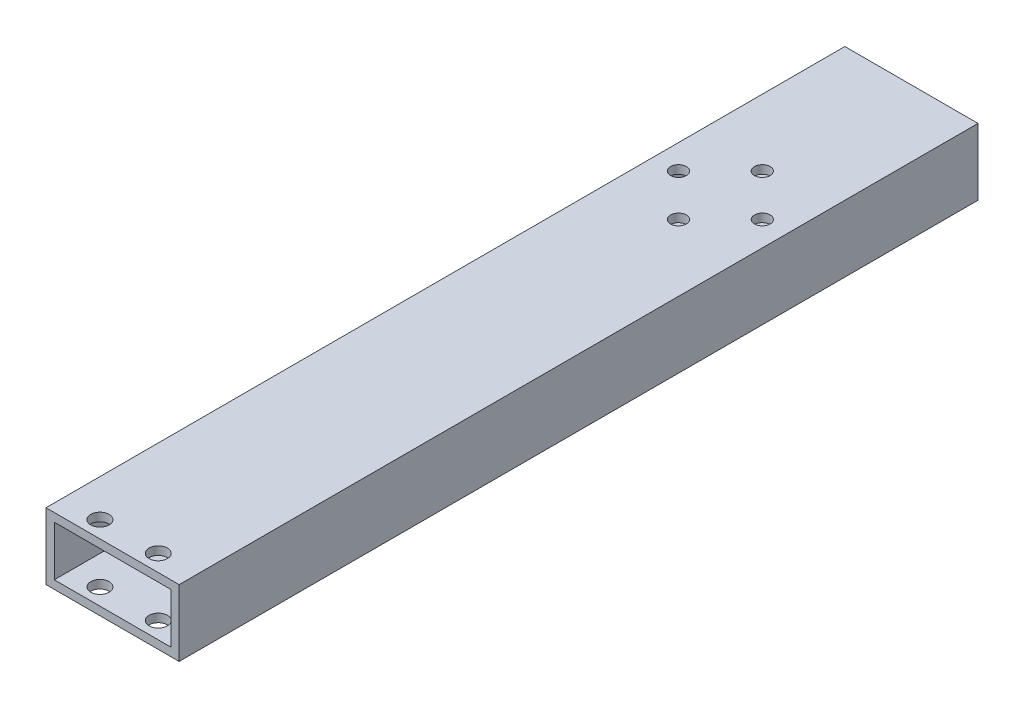
ISO-10303-21;
HEADER;
FILE_DESCRIPTION(('STEP AP214'),'2;1');
FILE_NAME('part.step','',(''),(''),'','','');
FILE_SCHEMA(('AUTOMOTIVE_DESIGN { 1 0 10303 214 1 1 1 1 }'));
ENDSEC;
DATA;
#1=APPLICATION_CONTEXT('core data for automotive mechanical design processes');
#2=APPLICATION_PROTOCOL_DEFINITION('international standard','automotive_design',2000,#1);
#3=PRODUCT_CONTEXT('',#1,'mechanical');
#4=PRODUCT('Part','Part','',(#3));
#5=PRODUCT_RELATED_PRODUCT_CATEGORY('part','',(#4));
#6=PRODUCT_DEFINITION_FORMATION('','',#4);
#7=PRODUCT_DEFINITION_CONTEXT('part definition',#1,'design');
#8=PRODUCT_DEFINITION('design','',#6,#7);
#9=PRODUCT_DEFINITION_SHAPE('','',#8);
#10=(LENGTH_UNIT() NAMED_UNIT(*) SI_UNIT(.MILLI.,.METRE.));
#11=(NAMED_UNIT(*) PLANE_ANGLE_UNIT() SI_UNIT($,.RADIAN.));
#12=(NAMED_UNIT(*) SI_UNIT($,.STERADIAN.) SOLID_ANGLE_UNIT());
#13=UNCERTAINTY_MEASURE_WITH_UNIT(LENGTH_MEASURE(1.E-05),#10,'distance_accuracy_value','');
#14=(GEOMETRIC_REPRESENTATION_CONTEXT(3) GLOBAL_UNCERTAINTY_ASSIGNED_CONTEXT((#13)) GLOBAL_UNIT_ASSIGNED_CONTEXT((#10,
#11,#12)) REPRESENTATION_CONTEXT('',''));
#15=CARTESIAN_POINT('',(0.,0.,0.));
#16=DIRECTION('',(0.,0.,1.));
#17=DIRECTION('',(1.,0.,0.));
#18=AXIS2_PLACEMENT_3D('',#15,#16,#17);
#19=CARTESIAN_POINT('',(-12.7,6.35,127.));
#20=DIRECTION('',(1.,0.,0.));
#21=DIRECTION('',(0.,0.,-1.));
#22=AXIS2_PLACEMENT_3D('',#19,#20,#21);
#23=PLANE('',#22);
#24=DIRECTION('',(0.,0.,-1.));
#25=VECTOR('',#24,1.);
#26=CARTESIAN_POINT('',(-12.7,6.35,127.));
#27=LINE('',#26,#25);
#28=CARTESIAN_POINT('',(-12.7,6.35,127.));
#29=VERTEX_POINT('',#28);
#30=CARTESIAN_POINT('',(-12.7,6.35,-25.4));
#31=VERTEX_POINT('',#30);
#32=EDGE_CURVE('E278',#29,#31,#27,.T.);
#33=ORIENTED_EDGE('',*,*,#32,.T.);
#34=DIRECTION('',(0.,1.,0.));
#35=VECTOR('',#34,1.);
#36=CARTESIAN_POINT('',(-12.7,6.35,-25.4));
#37=LINE('',#36,#35);
#38=CARTESIAN_POINT('',(-12.7,-6.35,-25.4));
#39=VERTEX_POINT('',#38);
#40=EDGE_CURVE('E165',#39,#31,#37,.T.);
#41=ORIENTED_EDGE('',*,*,#40,.F.);
#42=DIRECTION('',(0.,0.,-1.));
#43=VECTOR('',#42,1.);
#44=CARTESIAN_POINT('',(-12.7,-6.35,127.));
#45=LINE('',#44,#43);
#46=CARTESIAN_POINT('',(-12.7,-6.35,127.));
#47=VERTEX_POINT('',#46);
#48=EDGE_CURVE('E13',#47,#39,#45,.T.);
#49=ORIENTED_EDGE('',*,*,#48,.F.);
#50=DIRECTION('',(0.,-1.,0.));
#51=VECTOR('',#50,1.);
#52=CARTESIAN_POINT('',(-12.7,6.35,127.));
#53=LINE('',#52,#51);
#54=EDGE_CURVE('E262',#29,#47,#53,.T.);
#55=ORIENTED_EDGE('',*,*,#54,.F.);
#56=EDGE_LOOP('',(#33,#41,#49,#55));
#57=FACE_BOUND('',#56,.T.);
#58=ADVANCED_FACE('F55',(#57),#23,.F.);
#59=CARTESIAN_POINT('',(-12.7,-6.35,127.));
#60=DIRECTION('',(0.,1.,0.));
#61=DIRECTION('',(0.,0.,1.));
#62=AXIS2_PLACEMENT_3D('',#59,#60,#61);
#63=PLANE('',#62);
#64=CARTESIAN_POINT('',(0.,-6.35,3.05000000000001));
#65=DIRECTION('',(0.,-1.,0.));
#66=DIRECTION('',(0.,0.,-1.));
#67=AXIS2_PLACEMENT_3D('',#64,#65,#66);
#68=CIRCLE('',#67,1.5);
#69=CARTESIAN_POINT('',(0.,-6.35,1.55000000000001));
#70=VERTEX_POINT('',#69);
#71=EDGE_CURVE('E179',#70,#70,#68,.T.);
#72=ORIENTED_EDGE('',*,*,#71,.F.);
#73=EDGE_LOOP('',(#72));
#74=FACE_BOUND('',#73,.T.);
#75=CARTESIAN_POINT('',(8.,-6.35,11.05));
#76=DIRECTION('',(0.,-1.,0.));
#77=DIRECTION('',(0.,0.,-1.));
#78=AXIS2_PLACEMENT_3D('',#75,#76,#77);
#79=CIRCLE('',#78,1.5);
#80=CARTESIAN_POINT('',(8.,-6.35,9.55000000000001));
#81=VERTEX_POINT('',#80);
#82=EDGE_CURVE('E183',#81,#81,#79,.T.);
#83=ORIENTED_EDGE('',*,*,#82,.F.);
#84=EDGE_LOOP('',(#83));
#85=FACE_BOUND('',#84,.T.);
#86=CARTESIAN_POINT('',(0.,-6.35,19.05));
#87=DIRECTION('',(0.,-1.,0.));
#88=DIRECTION('',(0.,0.,-1.));
#89=AXIS2_PLACEMENT_3D('',#86,#87,#88);
#90=CIRCLE('',#89,1.5);
#91=CARTESIAN_POINT('',(0.,-6.35,17.55));
#92=VERTEX_POINT('',#91);
#93=EDGE_CURVE('E191',#92,#92,#90,.T.);
#94=ORIENTED_EDGE('',*,*,#93,.F.);
#95=EDGE_LOOP('',(#94));
#96=FACE_BOUND('',#95,.T.);
#97=CARTESIAN_POINT('',(-8.,-6.35,11.05));
#98=DIRECTION('',(0.,-1.,0.));
#99=DIRECTION('',(0.,0.,-1.));
#100=AXIS2_PLACEMENT_3D('',#97,#98,#99);
#101=CIRCLE('',#100,1.5);
#102=CARTESIAN_POINT('',(-8.,-6.35,9.55000000000001));
#103=VERTEX_POINT('',#102);
#104=EDGE_CURVE('E199',#103,#103,#101,.T.);
#105=ORIENTED_EDGE('',*,*,#104,.F.);
#106=EDGE_LOOP('',(#105));
#107=FACE_BOUND('',#106,.T.);
#108=CARTESIAN_POINT('',(-5.588,-6.35,123.825));
#109=DIRECTION('',(0.,1.,0.));
#110=DIRECTION('',(0.,0.,1.));
#111=AXIS2_PLACEMENT_3D('',#108,#109,#110);
#112=CIRCLE('',#111,1.7526);
#113=CARTESIAN_POINT('',(-5.588,-6.35,125.5776));
#114=VERTEX_POINT('',#113);
#115=EDGE_CURVE('E225',#114,#114,#112,.T.);
#116=ORIENTED_EDGE('',*,*,#115,.T.);
#117=EDGE_LOOP('',(#116));
#118=FACE_BOUND('',#117,.T.);
#119=CARTESIAN_POINT('',(5.5372,-6.35,123.825));
#120=DIRECTION('',(0.,1.,0.));
#121=DIRECTION('',(0.,0.,1.));
#122=AXIS2_PLACEMENT_3D('',#119,#120,#121);
#123=CIRCLE('',#122,1.7526);
#124=CARTESIAN_POINT('',(5.5372,-6.35,125.5776));
#125=VERTEX_POINT('',#124);
#126=EDGE_CURVE('E224',#125,#125,#123,.T.);
#127=ORIENTED_EDGE('',*,*,#126,.T.);
#128=EDGE_LOOP('',(#127));
#129=FACE_BOUND('',#128,.T.);
#130=ORIENTED_EDGE('',*,*,#48,.T.);
#131=DIRECTION('',(-1.,0.,0.));
#132=VECTOR('',#131,1.);
#133=CARTESIAN_POINT('',(12.7,-6.35,-25.4));
#134=LINE('',#133,#132);
#135=CARTESIAN_POINT('',(12.7,-6.35,-25.4));
#136=VERTEX_POINT('',#135);
#137=EDGE_CURVE('E161',#136,#39,#134,.T.);
#138=ORIENTED_EDGE('',*,*,#137,.F.);
#139=DIRECTION('',(0.,0.,-1.));
#140=VECTOR('',#139,1.);
#141=CARTESIAN_POINT('',(12.7,-6.35,127.));
#142=LINE('',#141,#140);
#143=CARTESIAN_POINT('',(12.7,-6.35,127.));
#144=VERTEX_POINT('',#143);
#145=EDGE_CURVE('E64',#144,#136,#142,.T.);
#146=ORIENTED_EDGE('',*,*,#145,.F.);
#147=DIRECTION('',(1.,0.,0.));
#148=VECTOR('',#147,1.);
#149=CARTESIAN_POINT('',(-12.7,-6.35,127.));
#150=LINE('',#149,#148);
#151=EDGE_CURVE('E270',#47,#144,#150,.T.);
#152=ORIENTED_EDGE('',*,*,#151,.F.);
#153=EDGE_LOOP('',(#130,#138,#146,#152));
#154=FACE_BOUND('',#153,.T.);
#155=ADVANCED_FACE('F325',(#74,#85,#96,#107,#118,#129,#154),#63,.F.);
#156=CARTESIAN_POINT('',(12.7,6.35,127.));
#157=DIRECTION('',(-1.,0.,0.));
#158=DIRECTION('',(0.,0.,1.));
#159=AXIS2_PLACEMENT_3D('',#156,#157,#158);
#160=PLANE('',#159);
#161=ORIENTED_EDGE('',*,*,#145,.T.);
#162=DIRECTION('',(0.,-1.,0.));
#163=VECTOR('',#162,1.);
#164=CARTESIAN_POINT('',(12.7,6.35,-25.4));
#165=LINE('',#164,#163);
#166=CARTESIAN_POINT('',(12.7,6.35,-25.4));
#167=VERTEX_POINT('',#166);
#168=EDGE_CURVE('E157',#167,#136,#165,.T.);
#169=ORIENTED_EDGE('',*,*,#168,.F.);
#170=DIRECTION('',(0.,0.,-1.));
#171=VECTOR('',#170,1.);
#172=CARTESIAN_POINT('',(12.7,6.35,127.));
#173=LINE('',#172,#171);
#174=CARTESIAN_POINT('',(12.7,6.35,127.));
#175=VERTEX_POINT('',#174);
#176=EDGE_CURVE('E281',#175,#167,#173,.T.);
#177=ORIENTED_EDGE('',*,*,#176,.F.);
#178=DIRECTION('',(0.,1.,0.));
#179=VECTOR('',#178,1.);
#180=CARTESIAN_POINT('',(12.7,6.35,127.));
#181=LINE('',#180,#179);
#182=EDGE_CURVE('E273',#144,#175,#181,.T.);
#183=ORIENTED_EDGE('',*,*,#182,.F.);
#184=EDGE_LOOP('',(#161,#169,#177,#183));
#185=FACE_BOUND('',#184,.T.);
#186=ADVANCED_FACE('F330',(#185),#160,.F.);
#187=CARTESIAN_POINT('',(-12.7,6.35,127.));
#188=DIRECTION('',(0.,-1.,0.));
#189=DIRECTION('',(0.,0.,-1.));
#190=AXIS2_PLACEMENT_3D('',#187,#188,#189);
#191=PLANE('',#190);
#192=CARTESIAN_POINT('',(0.,6.35,3.05000000000001));
#193=DIRECTION('',(0.,-1.,0.));
#194=DIRECTION('',(0.,0.,-1.));
#195=AXIS2_PLACEMENT_3D('',#192,#193,#194);
#196=CIRCLE('',#195,1.5);
#197=CARTESIAN_POINT('',(0.,6.35,1.55000000000001));
#198=VERTEX_POINT('',#197);
#199=EDGE_CURVE('E174',#198,#198,#196,.T.);
#200=ORIENTED_EDGE('',*,*,#199,.T.);
#201=EDGE_LOOP('',(#200));
#202=FACE_BOUND('',#201,.T.);
#203=CARTESIAN_POINT('',(8.,6.35,11.05));
#204=DIRECTION('',(0.,-1.,0.));
#205=DIRECTION('',(0.,0.,-1.));
#206=AXIS2_PLACEMENT_3D('',#203,#204,#205);
#207=CIRCLE('',#206,1.5);
#208=CARTESIAN_POINT('',(8.,6.35,9.55000000000001));
#209=VERTEX_POINT('',#208);
#210=EDGE_CURVE('E187',#209,#209,#207,.T.);
#211=ORIENTED_EDGE('',*,*,#210,.T.);
#212=EDGE_LOOP('',(#211));
#213=FACE_BOUND('',#212,.T.);
#214=CARTESIAN_POINT('',(0.,6.35,19.05));
#215=DIRECTION('',(0.,-1.,0.));
#216=DIRECTION('',(0.,0.,-1.));
#217=AXIS2_PLACEMENT_3D('',#214,#215,#216);
#218=CIRCLE('',#217,1.5);
#219=CARTESIAN_POINT('',(0.,6.35,17.55));
#220=VERTEX_POINT('',#219);
#221=EDGE_CURVE('E195',#220,#220,#218,.T.);
#222=ORIENTED_EDGE('',*,*,#221,.T.);
#223=EDGE_LOOP('',(#222));
#224=FACE_BOUND('',#223,.T.);
#225=CARTESIAN_POINT('',(-8.,6.35,11.05));
#226=DIRECTION('',(0.,-1.,0.));
#227=DIRECTION('',(0.,0.,-1.));
#228=AXIS2_PLACEMENT_3D('',#225,#226,#227);
#229=CIRCLE('',#228,1.5);
#230=CARTESIAN_POINT('',(-8.,6.35,9.55000000000001));
#231=VERTEX_POINT('',#230);
#232=EDGE_CURVE('E173',#231,#231,#229,.T.);
#233=ORIENTED_EDGE('',*,*,#232,.T.);
#234=EDGE_LOOP('',(#233));
#235=FACE_BOUND('',#234,.T.);
#236=CARTESIAN_POINT('',(-5.588,6.35,123.825));
#237=DIRECTION('',(0.,-1.,0.));
#238=DIRECTION('',(0.,0.,-1.));
#239=AXIS2_PLACEMENT_3D('',#236,#237,#238);
#240=CIRCLE('',#239,1.7526);
#241=CARTESIAN_POINT('',(-5.588,6.35,122.0724));
#242=VERTEX_POINT('',#241);
#243=EDGE_CURVE('E246',#242,#242,#240,.T.);
#244=ORIENTED_EDGE('',*,*,#243,.T.);
#245=EDGE_LOOP('',(#244));
#246=FACE_BOUND('',#245,.T.);
#247=CARTESIAN_POINT('',(5.5372,6.35,123.825));
#248=DIRECTION('',(0.,-1.,0.));
#249=DIRECTION('',(0.,0.,-1.));
#250=AXIS2_PLACEMENT_3D('',#247,#248,#249);
#251=CIRCLE('',#250,1.7526);
#252=CARTESIAN_POINT('',(5.5372,6.35,122.0724));
#253=VERTEX_POINT('',#252);
#254=EDGE_CURVE('E237',#253,#253,#251,.T.);
#255=ORIENTED_EDGE('',*,*,#254,.T.);
#256=EDGE_LOOP('',(#255));
#257=FACE_BOUND('',#256,.T.);
#258=ORIENTED_EDGE('',*,*,#176,.T.);
#259=DIRECTION('',(1.,0.,0.));
#260=VECTOR('',#259,1.);
#261=CARTESIAN_POINT('',(12.7,6.35,-25.4));
#262=LINE('',#261,#260);
#263=EDGE_CURVE('E169',#31,#167,#262,.T.);
#264=ORIENTED_EDGE('',*,*,#263,.F.);
#265=ORIENTED_EDGE('',*,*,#32,.F.);
#266=DIRECTION('',(-1.,0.,0.));
#267=VECTOR('',#266,1.);
#268=CARTESIAN_POINT('',(-12.7,6.35,127.));
#269=LINE('',#268,#267);
#270=EDGE_CURVE('E80',#175,#29,#269,.T.);
#271=ORIENTED_EDGE('',*,*,#270,.F.);
#272=EDGE_LOOP('',(#258,#264,#265,#271));
#273=FACE_BOUND('',#272,.T.);
#274=ADVANCED_FACE('F340',(#202,#213,#224,#235,#246,#257,#273),#191,.F.);
#275=CARTESIAN_POINT('',(0.,0.,127.));
#276=DIRECTION('',(0.,0.,1.));
#277=DIRECTION('',(1.,0.,0.));
#278=AXIS2_PLACEMENT_3D('',#275,#276,#277);
#279=PLANE('',#278);
#280=DIRECTION('',(0.,-1.,0.));
#281=VECTOR('',#280,1.);
#282=CARTESIAN_POINT('',(11.1125,4.7625,127.));
#283=LINE('',#282,#281);
#284=CARTESIAN_POINT('',(11.1125,4.7625,127.));
#285=VERTEX_POINT('',#284);
#286=CARTESIAN_POINT('',(11.1125,-4.7625,127.));
#287=VERTEX_POINT('',#286);
#288=EDGE_CURVE('E250',#285,#287,#283,.T.);
#289=ORIENTED_EDGE('',*,*,#288,.T.);
#290=DIRECTION('',(-1.,0.,0.));
#291=VECTOR('',#290,1.);
#292=CARTESIAN_POINT('',(11.1125,-4.7625,127.));
#293=LINE('',#292,#291);
#294=CARTESIAN_POINT('',(-11.1125,-4.7625,127.));
#295=VERTEX_POINT('',#294);
#296=EDGE_CURVE('E129',#287,#295,#293,.T.);
#297=ORIENTED_EDGE('',*,*,#296,.T.);
#298=DIRECTION('',(0.,1.,0.));
#299=VECTOR('',#298,1.);
#300=CARTESIAN_POINT('',(-11.1125,4.7625,127.));
#301=LINE('',#300,#299);
#302=CARTESIAN_POINT('',(-11.1125,4.7625,127.));
#303=VERTEX_POINT('',#302);
#304=EDGE_CURVE('E72',#295,#303,#301,.T.);
#305=ORIENTED_EDGE('',*,*,#304,.T.);
#306=DIRECTION('',(1.,0.,0.));
#307=VECTOR('',#306,1.);
#308=CARTESIAN_POINT('',(11.1125,4.7625,127.));
#309=LINE('',#308,#307);
#310=EDGE_CURVE('E135',#303,#285,#309,.T.);
#311=ORIENTED_EDGE('',*,*,#310,.T.);
#312=EDGE_LOOP('',(#289,#297,#305,#311));
#313=FACE_BOUND('',#312,.T.);
#314=ORIENTED_EDGE('',*,*,#54,.T.);
#315=ORIENTED_EDGE('',*,*,#151,.T.);
#316=ORIENTED_EDGE('',*,*,#182,.T.);
#317=ORIENTED_EDGE('',*,*,#270,.T.);
#318=EDGE_LOOP('',(#314,#315,#316,#317));
#319=FACE_BOUND('',#318,.T.);
#320=ADVANCED_FACE('F346',(#313,#319),#279,.T.);
#321=CARTESIAN_POINT('',(11.1125,4.7625,127.));
#322=DIRECTION('',(1.,0.,0.));
#323=DIRECTION('',(0.,0.,-1.));
#324=AXIS2_PLACEMENT_3D('',#321,#322,#323);
#325=PLANE('',#324);
#326=DIRECTION('',(0.,0.,-1.));
#327=VECTOR('',#326,1.);
#328=CARTESIAN_POINT('',(11.1125,4.7625,127.));
#329=LINE('',#328,#327);
#330=CARTESIAN_POINT('',(11.1125,4.7625,-25.4));
#331=VERTEX_POINT('',#330);
#332=EDGE_CURVE('E140',#285,#331,#329,.T.);
#333=ORIENTED_EDGE('',*,*,#332,.T.);
#334=DIRECTION('',(0.,-1.,0.));
#335=VECTOR('',#334,1.);
#336=CARTESIAN_POINT('',(11.1125,4.7625,-25.4));
#337=LINE('',#336,#335);
#338=CARTESIAN_POINT('',(11.1125,-4.7625,-25.4));
#339=VERTEX_POINT('',#338);
#340=EDGE_CURVE('E138',#331,#339,#337,.T.);
#341=ORIENTED_EDGE('',*,*,#340,.T.);
#342=DIRECTION('',(0.,0.,-1.));
#343=VECTOR('',#342,1.);
#344=CARTESIAN_POINT('',(11.1125,-4.7625,127.));
#345=LINE('',#344,#343);
#346=EDGE_CURVE('E122',#287,#339,#345,.T.);
#347=ORIENTED_EDGE('',*,*,#346,.F.);
#348=ORIENTED_EDGE('',*,*,#288,.F.);
#349=EDGE_LOOP('',(#333,#341,#347,#348));
#350=FACE_BOUND('',#349,.T.);
#351=ADVANCED_FACE('F139',(#350),#325,.F.);
#352=CARTESIAN_POINT('',(11.1125,4.7625,127.));
#353=DIRECTION('',(0.,1.,0.));
#354=DIRECTION('',(0.,0.,1.));
#355=AXIS2_PLACEMENT_3D('',#352,#353,#354);
#356=PLANE('',#355);
#357=CARTESIAN_POINT('',(0.,4.7625,3.05000000000001));
#358=DIRECTION('',(0.,1.,0.));
#359=DIRECTION('',(0.,0.,1.));
#360=AXIS2_PLACEMENT_3D('',#357,#358,#359);
#361=CIRCLE('',#360,1.5);
#362=CARTESIAN_POINT('',(0.,4.7625,4.55000000000001));
#363=VERTEX_POINT('',#362);
#364=EDGE_CURVE('E220',#363,#363,#361,.T.);
#365=ORIENTED_EDGE('',*,*,#364,.T.);
#366=EDGE_LOOP('',(#365));
#367=FACE_BOUND('',#366,.T.);
#368=CARTESIAN_POINT('',(8.,4.7625,11.05));
#369=DIRECTION('',(0.,1.,0.));
#370=DIRECTION('',(0.,0.,1.));
#371=AXIS2_PLACEMENT_3D('',#368,#369,#370);
#372=CIRCLE('',#371,1.5);
#373=CARTESIAN_POINT('',(8.,4.7625,12.55));
#374=VERTEX_POINT('',#373);
#375=EDGE_CURVE('E216',#374,#374,#372,.T.);
#376=ORIENTED_EDGE('',*,*,#375,.T.);
#377=EDGE_LOOP('',(#376));
#378=FACE_BOUND('',#377,.T.);
#379=CARTESIAN_POINT('',(0.,4.7625,19.05));
#380=DIRECTION('',(0.,1.,0.));
#381=DIRECTION('',(0.,0.,1.));
#382=AXIS2_PLACEMENT_3D('',#379,#380,#381);
#383=CIRCLE('',#382,1.5);
#384=CARTESIAN_POINT('',(0.,4.7625,20.55));
#385=VERTEX_POINT('',#384);
#386=EDGE_CURVE('E211',#385,#385,#383,.T.);
#387=ORIENTED_EDGE('',*,*,#386,.T.);
#388=EDGE_LOOP('',(#387));
#389=FACE_BOUND('',#388,.T.);
#390=CARTESIAN_POINT('',(-8.,4.7625,11.05));
#391=DIRECTION('',(0.,1.,0.));
#392=DIRECTION('',(0.,0.,1.));
#393=AXIS2_PLACEMENT_3D('',#390,#391,#392);
#394=CIRCLE('',#393,1.5);
#395=CARTESIAN_POINT('',(-8.,4.7625,12.55));
#396=VERTEX_POINT('',#395);
#397=EDGE_CURVE('E206',#396,#396,#394,.T.);
#398=ORIENTED_EDGE('',*,*,#397,.T.);
#399=EDGE_LOOP('',(#398));
#400=FACE_BOUND('',#399,.T.);
#401=CARTESIAN_POINT('',(-5.588,4.7625,123.825));
#402=DIRECTION('',(0.,1.,0.));
#403=DIRECTION('',(0.,0.,1.));
#404=AXIS2_PLACEMENT_3D('',#401,#402,#403);
#405=CIRCLE('',#404,1.7526);
#406=CARTESIAN_POINT('',(-5.588,4.7625,125.5776));
#407=VERTEX_POINT('',#406);
#408=EDGE_CURVE('E242',#407,#407,#405,.T.);
#409=ORIENTED_EDGE('',*,*,#408,.T.);
#410=EDGE_LOOP('',(#409));
#411=FACE_BOUND('',#410,.T.);
#412=CARTESIAN_POINT('',(5.5372,4.7625,123.825));
#413=DIRECTION('',(0.,1.,0.));
#414=DIRECTION('',(0.,0.,1.));
#415=AXIS2_PLACEMENT_3D('',#412,#413,#414);
#416=CIRCLE('',#415,1.7526);
#417=CARTESIAN_POINT('',(5.5372,4.7625,125.5776));
#418=VERTEX_POINT('',#417);
#419=EDGE_CURVE('E233',#418,#418,#416,.T.);
#420=ORIENTED_EDGE('',*,*,#419,.T.);
#421=EDGE_LOOP('',(#420));
#422=FACE_BOUND('',#421,.T.);
#423=DIRECTION('',(0.,0.,-1.));
#424=VECTOR('',#423,1.);
#425=CARTESIAN_POINT('',(-11.1125,4.7625,127.));
#426=LINE('',#425,#424);
#427=CARTESIAN_POINT('',(-11.1125,4.7625,-25.4));
#428=VERTEX_POINT('',#427);
#429=EDGE_CURVE('E263',#303,#428,#426,.T.);
#430=ORIENTED_EDGE('',*,*,#429,.T.);
#431=DIRECTION('',(1.,0.,0.));
#432=VECTOR('',#431,1.);
#433=CARTESIAN_POINT('',(11.1125,4.7625,-25.4));
#434=LINE('',#433,#432);
#435=EDGE_CURVE('E152',#428,#331,#434,.T.);
#436=ORIENTED_EDGE('',*,*,#435,.T.);
#437=ORIENTED_EDGE('',*,*,#332,.F.);
#438=ORIENTED_EDGE('',*,*,#310,.F.);
#439=EDGE_LOOP('',(#430,#436,#437,#438));
#440=FACE_BOUND('',#439,.T.);
#441=ADVANCED_FACE('F354',(#367,#378,#389,#400,#411,#422,#440),#356,.F.);
#442=CARTESIAN_POINT('',(-11.1125,4.7625,127.));
#443=DIRECTION('',(-1.,0.,0.));
#444=DIRECTION('',(0.,-1.,0.));
#445=AXIS2_PLACEMENT_3D('',#442,#443,#444);
#446=PLANE('',#445);
#447=DIRECTION('',(0.,0.,-1.));
#448=VECTOR('',#447,1.);
#449=CARTESIAN_POINT('',(-11.1125,-4.7625,127.));
#450=LINE('',#449,#448);
#451=CARTESIAN_POINT('',(-11.1125,-4.7625,-25.4));
#452=VERTEX_POINT('',#451);
#453=EDGE_CURVE('E134',#295,#452,#450,.T.);
#454=ORIENTED_EDGE('',*,*,#453,.T.);
#455=DIRECTION('',(0.,1.,0.));
#456=VECTOR('',#455,1.);
#457=CARTESIAN_POINT('',(-11.1125,4.7625,-25.4));
#458=LINE('',#457,#456);
#459=EDGE_CURVE('E148',#452,#428,#458,.T.);
#460=ORIENTED_EDGE('',*,*,#459,.T.);
#461=ORIENTED_EDGE('',*,*,#429,.F.);
#462=ORIENTED_EDGE('',*,*,#304,.F.);
#463=EDGE_LOOP('',(#454,#460,#461,#462));
#464=FACE_BOUND('',#463,.T.);
#465=ADVANCED_FACE('F386',(#464),#446,.F.);
#466=CARTESIAN_POINT('',(11.1125,-4.7625,127.));
#467=DIRECTION('',(0.,-1.,0.));
#468=DIRECTION('',(0.,0.,-1.));
#469=AXIS2_PLACEMENT_3D('',#466,#467,#468);
#470=PLANE('',#469);
#471=CARTESIAN_POINT('',(0.,-4.7625,3.05000000000001));
#472=DIRECTION('',(0.,-1.,0.));
#473=DIRECTION('',(0.,0.,-1.));
#474=AXIS2_PLACEMENT_3D('',#471,#472,#473);
#475=CIRCLE('',#474,1.5);
#476=CARTESIAN_POINT('',(0.,-4.7625,1.55000000000001));
#477=VERTEX_POINT('',#476);
#478=EDGE_CURVE('E58',#477,#477,#475,.T.);
#479=ORIENTED_EDGE('',*,*,#478,.T.);
#480=EDGE_LOOP('',(#479));
#481=FACE_BOUND('',#480,.T.);
#482=CARTESIAN_POINT('',(8.,-4.7625,11.05));
#483=DIRECTION('',(0.,-1.,0.));
#484=DIRECTION('',(0.,0.,-1.));
#485=AXIS2_PLACEMENT_3D('',#482,#483,#484);
#486=CIRCLE('',#485,1.5);
#487=CARTESIAN_POINT('',(8.,-4.7625,9.55000000000001));
#488=VERTEX_POINT('',#487);
#489=EDGE_CURVE('E215',#488,#488,#486,.T.);
#490=ORIENTED_EDGE('',*,*,#489,.T.);
#491=EDGE_LOOP('',(#490));
#492=FACE_BOUND('',#491,.T.);
#493=CARTESIAN_POINT('',(0.,-4.7625,19.05));
#494=DIRECTION('',(0.,-1.,0.));
#495=DIRECTION('',(0.,0.,-1.));
#496=AXIS2_PLACEMENT_3D('',#493,#494,#495);
#497=CIRCLE('',#496,1.5);
#498=CARTESIAN_POINT('',(0.,-4.7625,17.55));
#499=VERTEX_POINT('',#498);
#500=EDGE_CURVE('E210',#499,#499,#497,.T.);
#501=ORIENTED_EDGE('',*,*,#500,.T.);
#502=EDGE_LOOP('',(#501));
#503=FACE_BOUND('',#502,.T.);
#504=CARTESIAN_POINT('',(-8.,-4.7625,11.05));
#505=DIRECTION('',(0.,-1.,0.));
#506=DIRECTION('',(0.,0.,-1.));
#507=AXIS2_PLACEMENT_3D('',#504,#505,#506);
#508=CIRCLE('',#507,1.5);
#509=CARTESIAN_POINT('',(-8.,-4.7625,9.55000000000001));
#510=VERTEX_POINT('',#509);
#511=EDGE_CURVE('E178',#510,#510,#508,.T.);
#512=ORIENTED_EDGE('',*,*,#511,.T.);
#513=EDGE_LOOP('',(#512));
#514=FACE_BOUND('',#513,.T.);
#515=CARTESIAN_POINT('',(-5.588,-4.7625,123.825));
#516=DIRECTION('',(0.,-1.,0.));
#517=DIRECTION('',(0.,0.,-1.));
#518=AXIS2_PLACEMENT_3D('',#515,#516,#517);
#519=CIRCLE('',#518,1.7526);
#520=CARTESIAN_POINT('',(-5.588,-4.7625,122.0724));
#521=VERTEX_POINT('',#520);
#522=EDGE_CURVE('E241',#521,#521,#519,.T.);
#523=ORIENTED_EDGE('',*,*,#522,.T.);
#524=EDGE_LOOP('',(#523));
#525=FACE_BOUND('',#524,.T.);
#526=CARTESIAN_POINT('',(5.5372,-4.7625,123.825));
#527=DIRECTION('',(0.,-1.,0.));
#528=DIRECTION('',(0.,0.,-1.));
#529=AXIS2_PLACEMENT_3D('',#526,#527,#528);
#530=CIRCLE('',#529,1.7526);
#531=CARTESIAN_POINT('',(5.5372,-4.7625,122.0724));
#532=VERTEX_POINT('',#531);
#533=EDGE_CURVE('E229',#532,#532,#530,.T.);
#534=ORIENTED_EDGE('',*,*,#533,.T.);
#535=EDGE_LOOP('',(#534));
#536=FACE_BOUND('',#535,.T.);
#537=ORIENTED_EDGE('',*,*,#346,.T.);
#538=DIRECTION('',(-1.,0.,0.));
#539=VECTOR('',#538,1.);
#540=CARTESIAN_POINT('',(11.1125,-4.7625,-25.4));
#541=LINE('',#540,#539);
#542=EDGE_CURVE('E126',#339,#452,#541,.T.);
#543=ORIENTED_EDGE('',*,*,#542,.T.);
#544=ORIENTED_EDGE('',*,*,#453,.F.);
#545=ORIENTED_EDGE('',*,*,#296,.F.);
#546=EDGE_LOOP('',(#537,#543,#544,#545));
#547=FACE_BOUND('',#546,.T.);
#548=ADVANCED_FACE('F124',(#481,#492,#503,#514,#525,#536,#547),#470,.F.);
#549=CARTESIAN_POINT('',(5.5372,-6.35,123.825));
#550=DIRECTION('',(0.,1.,0.));
#551=DIRECTION('',(0.,0.,1.));
#552=AXIS2_PLACEMENT_3D('',#549,#550,#551);
#553=CYLINDRICAL_SURFACE('',#552,1.7526);
#554=ORIENTED_EDGE('',*,*,#126,.F.);
#555=EDGE_LOOP('',(#554));
#556=FACE_BOUND('',#555,.T.);
#557=ORIENTED_EDGE('',*,*,#533,.F.);
#558=EDGE_LOOP('',(#557));
#559=FACE_BOUND('',#558,.T.);
#560=ADVANCED_FACE('F406',(#556,#559),#553,.F.);
#561=CARTESIAN_POINT('',(-5.588,-6.35,123.825));
#562=DIRECTION('',(0.,1.,0.));
#563=DIRECTION('',(0.,0.,1.));
#564=AXIS2_PLACEMENT_3D('',#561,#562,#563);
#565=CYLINDRICAL_SURFACE('',#564,1.7526);
#566=ORIENTED_EDGE('',*,*,#115,.F.);
#567=EDGE_LOOP('',(#566));
#568=FACE_BOUND('',#567,.T.);
#569=ORIENTED_EDGE('',*,*,#522,.F.);
#570=EDGE_LOOP('',(#569));
#571=FACE_BOUND('',#570,.T.);
#572=ADVANCED_FACE('F481',(#568,#571),#565,.F.);
#573=ORIENTED_EDGE('',*,*,#419,.F.);
#574=EDGE_LOOP('',(#573));
#575=FACE_BOUND('',#574,.T.);
#576=ORIENTED_EDGE('',*,*,#254,.F.);
#577=EDGE_LOOP('',(#576));
#578=FACE_BOUND('',#577,.T.);
#579=ADVANCED_FACE('F478',(#575,#578),#553,.F.);
#580=ORIENTED_EDGE('',*,*,#408,.F.);
#581=EDGE_LOOP('',(#580));
#582=FACE_BOUND('',#581,.T.);
#583=ORIENTED_EDGE('',*,*,#243,.F.);
#584=EDGE_LOOP('',(#583));
#585=FACE_BOUND('',#584,.T.);
#586=ADVANCED_FACE('F468',(#582,#585),#565,.F.);
#587=CARTESIAN_POINT('',(-8.,6.35,11.05));
#588=DIRECTION('',(0.,-1.,0.));
#589=DIRECTION('',(0.,0.,-1.));
#590=AXIS2_PLACEMENT_3D('',#587,#588,#589);
#591=CYLINDRICAL_SURFACE('',#590,1.5);
#592=ORIENTED_EDGE('',*,*,#104,.T.);
#593=EDGE_LOOP('',(#592));
#594=FACE_BOUND('',#593,.T.);
#595=ORIENTED_EDGE('',*,*,#511,.F.);
#596=EDGE_LOOP('',(#595));
#597=FACE_BOUND('',#596,.T.);
#598=ADVANCED_FACE('F318',(#594,#597),#591,.F.);
#599=CARTESIAN_POINT('',(0.,6.35,19.05));
#600=DIRECTION('',(0.,-1.,0.));
#601=DIRECTION('',(0.,0.,-1.));
#602=AXIS2_PLACEMENT_3D('',#599,#600,#601);
#603=CYLINDRICAL_SURFACE('',#602,1.5);
#604=ORIENTED_EDGE('',*,*,#93,.T.);
#605=EDGE_LOOP('',(#604));
#606=FACE_BOUND('',#605,.T.);
#607=ORIENTED_EDGE('',*,*,#500,.F.);
#608=EDGE_LOOP('',(#607));
#609=FACE_BOUND('',#608,.T.);
#610=ADVANCED_FACE('F306',(#606,#609),#603,.F.);
#611=CARTESIAN_POINT('',(8.,6.35,11.05));
#612=DIRECTION('',(0.,-1.,0.));
#613=DIRECTION('',(0.,0.,-1.));
#614=AXIS2_PLACEMENT_3D('',#611,#612,#613);
#615=CYLINDRICAL_SURFACE('',#614,1.5);
#616=ORIENTED_EDGE('',*,*,#82,.T.);
#617=EDGE_LOOP('',(#616));
#618=FACE_BOUND('',#617,.T.);
#619=ORIENTED_EDGE('',*,*,#489,.F.);
#620=EDGE_LOOP('',(#619));
#621=FACE_BOUND('',#620,.T.);
#622=ADVANCED_FACE('F303',(#618,#621),#615,.F.);
#623=CARTESIAN_POINT('',(0.,6.35,3.05000000000001));
#624=DIRECTION('',(0.,-1.,0.));
#625=DIRECTION('',(0.,0.,-1.));
#626=AXIS2_PLACEMENT_3D('',#623,#624,#625);
#627=CYLINDRICAL_SURFACE('',#626,1.5);
#628=ORIENTED_EDGE('',*,*,#71,.T.);
#629=EDGE_LOOP('',(#628));
#630=FACE_BOUND('',#629,.T.);
#631=ORIENTED_EDGE('',*,*,#478,.F.);
#632=EDGE_LOOP('',(#631));
#633=FACE_BOUND('',#632,.T.);
#634=ADVANCED_FACE('F305',(#630,#633),#627,.F.);
#635=ORIENTED_EDGE('',*,*,#232,.F.);
#636=EDGE_LOOP('',(#635));
#637=FACE_BOUND('',#636,.T.);
#638=ORIENTED_EDGE('',*,*,#397,.F.);
#639=EDGE_LOOP('',(#638));
#640=FACE_BOUND('',#639,.T.);
#641=ADVANCED_FACE('F314',(#637,#640),#591,.F.);
#642=ORIENTED_EDGE('',*,*,#221,.F.);
#643=EDGE_LOOP('',(#642));
#644=FACE_BOUND('',#643,.T.);
#645=ORIENTED_EDGE('',*,*,#386,.F.);
#646=EDGE_LOOP('',(#645));
#647=FACE_BOUND('',#646,.T.);
#648=ADVANCED_FACE('F321',(#644,#647),#603,.F.);
#649=ORIENTED_EDGE('',*,*,#210,.F.);
#650=EDGE_LOOP('',(#649));
#651=FACE_BOUND('',#650,.T.);
#652=ORIENTED_EDGE('',*,*,#375,.F.);
#653=EDGE_LOOP('',(#652));
#654=FACE_BOUND('',#653,.T.);
#655=ADVANCED_FACE('F309',(#651,#654),#615,.F.);
#656=ORIENTED_EDGE('',*,*,#199,.F.);
#657=EDGE_LOOP('',(#656));
#658=FACE_BOUND('',#657,.T.);
#659=ORIENTED_EDGE('',*,*,#364,.F.);
#660=EDGE_LOOP('',(#659));
#661=FACE_BOUND('',#660,.T.);
#662=ADVANCED_FACE('F317',(#658,#661),#627,.F.);
#663=CARTESIAN_POINT('',(0.,0.,-25.4));
#664=DIRECTION('',(0.,0.,-1.));
#665=DIRECTION('',(-1.,0.,0.));
#666=AXIS2_PLACEMENT_3D('',#663,#664,#665);
#667=PLANE('',#666);
#668=ORIENTED_EDGE('',*,*,#168,.T.);
#669=ORIENTED_EDGE('',*,*,#137,.T.);
#670=ORIENTED_EDGE('',*,*,#40,.T.);
#671=ORIENTED_EDGE('',*,*,#263,.T.);
#672=EDGE_LOOP('',(#668,#669,#670,#671));
#673=FACE_BOUND('',#672,.T.);
#674=ORIENTED_EDGE('',*,*,#542,.F.);
#675=ORIENTED_EDGE('',*,*,#340,.F.);
#676=ORIENTED_EDGE('',*,*,#435,.F.);
#677=ORIENTED_EDGE('',*,*,#459,.F.);
#678=EDGE_LOOP('',(#674,#675,#676,#677));
#679=FACE_BOUND('',#678,.T.);
#680=ADVANCED_FACE('F146',(#673,#679),#667,.T.);
#681=CLOSED_SHELL('',(#58,#155,#186,#274,#320,#351,#441,#465,#548,#560,#572,#579,#586,#598,#610,
#622,#634,#641,#648,#655,#662,#680));
#682=MANIFOLD_SOLID_BREP('B2',#681);
#683=ADVANCED_BREP_SHAPE_REPRESENTATION('',(#18,#682),#14);
#684=SHAPE_DEFINITION_REPRESENTATION(#9,#683);
ENDSEC;
END-ISO-10303-21;
